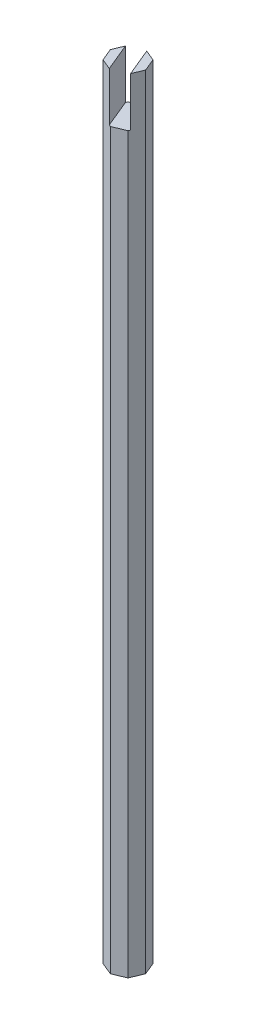
ISO-10303-21;
HEADER;
FILE_DESCRIPTION(('STEP AP214'),'2;1');
FILE_NAME('part.step','',(''),(''),'','','');
FILE_SCHEMA(('AUTOMOTIVE_DESIGN { 1 0 10303 214 1 1 1 1 }'));
ENDSEC;
DATA;
#1=APPLICATION_CONTEXT('core data for automotive mechanical design processes');
#2=APPLICATION_PROTOCOL_DEFINITION('international standard','automotive_design',2000,#1);
#3=PRODUCT_CONTEXT('',#1,'mechanical');
#4=PRODUCT('Part','Part','',(#3));
#5=PRODUCT_RELATED_PRODUCT_CATEGORY('part','',(#4));
#6=PRODUCT_DEFINITION_FORMATION('','',#4);
#7=PRODUCT_DEFINITION_CONTEXT('part definition',#1,'design');
#8=PRODUCT_DEFINITION('design','',#6,#7);
#9=PRODUCT_DEFINITION_SHAPE('','',#8);
#10=(LENGTH_UNIT() NAMED_UNIT(*) SI_UNIT(.MILLI.,.METRE.));
#11=(NAMED_UNIT(*) PLANE_ANGLE_UNIT() SI_UNIT($,.RADIAN.));
#12=(NAMED_UNIT(*) SI_UNIT($,.STERADIAN.) SOLID_ANGLE_UNIT());
#13=UNCERTAINTY_MEASURE_WITH_UNIT(LENGTH_MEASURE(1.E-05),#10,'distance_accuracy_value','');
#14=(GEOMETRIC_REPRESENTATION_CONTEXT(3) GLOBAL_UNCERTAINTY_ASSIGNED_CONTEXT((#13)) GLOBAL_UNIT_ASSIGNED_CONTEXT((#10,
#11,#12)) REPRESENTATION_CONTEXT('',''));
#15=CARTESIAN_POINT('',(0.,0.,0.));
#16=DIRECTION('',(0.,0.,1.));
#17=DIRECTION('',(1.,0.,0.));
#18=AXIS2_PLACEMENT_3D('',#15,#16,#17);
#19=CARTESIAN_POINT('',(-1.58536300828482E-13,609.6,-13.7463809437134));
#20=DIRECTION('',(0.3826834323651,0.,0.923879532511282));
#21=DIRECTION('',(0.923879532511282,0.,-0.3826834323651));
#22=AXIS2_PLACEMENT_3D('',#19,#20,#21);
#23=PLANE('',#22);
#24=DIRECTION('',(-0.92387953251128,0.,0.382683432365107));
#25=VECTOR('',#24,1.);
#26=CARTESIAN_POINT('',(-10.7267146224835,571.5,-9.30323026737482));
#27=LINE('',#26,#25);
#28=CARTESIAN_POINT('',(-1.75207071073658E-13,571.5,-13.7463809437134));
#29=VERTEX_POINT('',#28);
#30=CARTESIAN_POINT('',(-9.72015918207341,571.5,-9.72015918207312));
#31=VERTEX_POINT('',#30);
#32=EDGE_CURVE('E210',#29,#31,#27,.T.);
#33=ORIENTED_EDGE('',*,*,#32,.F.);
#34=DIRECTION('',(0.,-1.,0.));
#35=VECTOR('',#34,1.);
#36=CARTESIAN_POINT('',(-1.58536300828482E-13,609.6,-13.7463809437134));
#37=LINE('',#36,#35);
#38=CARTESIAN_POINT('',(-1.58536300828482E-13,0.,-13.7463809437134));
#39=VERTEX_POINT('',#38);
#40=EDGE_CURVE('E191',#29,#39,#37,.T.);
#41=ORIENTED_EDGE('',*,*,#40,.T.);
#42=DIRECTION('',(-0.923879532511282,0.,0.3826834323651));
#43=VECTOR('',#42,1.);
#44=CARTESIAN_POINT('',(-1.58536300828482E-13,0.,-13.7463809437134));
#45=LINE('',#44,#43);
#46=CARTESIAN_POINT('',(-9.72015918207339,0.,-9.72015918207317));
#47=VERTEX_POINT('',#46);
#48=EDGE_CURVE('E168',#39,#47,#45,.T.);
#49=ORIENTED_EDGE('',*,*,#48,.T.);
#50=DIRECTION('',(0.,-1.,0.));
#51=VECTOR('',#50,1.);
#52=CARTESIAN_POINT('',(-9.72015918207339,609.6,-9.72015918207317));
#53=LINE('',#52,#51);
#54=EDGE_CURVE('E189',#31,#47,#53,.T.);
#55=ORIENTED_EDGE('',*,*,#54,.F.);
#56=EDGE_LOOP('',(#33,#41,#49,#55));
#57=FACE_BOUND('',#56,.T.);
#58=ADVANCED_FACE('F35',(#57),#23,.F.);
#59=CARTESIAN_POINT('',(1.4871632129143E-13,609.6,13.7463809437134));
#60=DIRECTION('',(-0.382683432365099,0.,-0.923879532511283));
#61=DIRECTION('',(-0.923879532511283,0.,0.382683432365099));
#62=AXIS2_PLACEMENT_3D('',#59,#60,#61);
#63=PLANE('',#62);
#64=DIRECTION('',(0.923879532511279,0.,-0.382683432365107));
#65=VECTOR('',#64,1.);
#66=CARTESIAN_POINT('',(-1.00655544040976,571.5,14.1633098584117));
#67=LINE('',#66,#65);
#68=CARTESIAN_POINT('',(1.73038666728687E-13,571.5,13.7463809437135));
#69=VERTEX_POINT('',#68);
#70=CARTESIAN_POINT('',(9.72015918207338,571.5,9.72015918207314));
#71=VERTEX_POINT('',#70);
#72=EDGE_CURVE('E217',#69,#71,#67,.T.);
#73=ORIENTED_EDGE('',*,*,#72,.F.);
#74=DIRECTION('',(0.,-1.,0.));
#75=VECTOR('',#74,1.);
#76=CARTESIAN_POINT('',(1.4871632129143E-13,609.6,13.7463809437134));
#77=LINE('',#76,#75);
#78=CARTESIAN_POINT('',(1.4871632129143E-13,0.,13.7463809437134));
#79=VERTEX_POINT('',#78);
#80=EDGE_CURVE('E181',#69,#79,#77,.T.);
#81=ORIENTED_EDGE('',*,*,#80,.T.);
#82=DIRECTION('',(0.923879532511283,0.,-0.382683432365099));
#83=VECTOR('',#82,1.);
#84=CARTESIAN_POINT('',(1.4871632129143E-13,0.,13.7463809437134));
#85=LINE('',#84,#83);
#86=CARTESIAN_POINT('',(9.72015918207339,0.,9.72015918207317));
#87=VERTEX_POINT('',#86);
#88=EDGE_CURVE('E178',#79,#87,#85,.T.);
#89=ORIENTED_EDGE('',*,*,#88,.T.);
#90=DIRECTION('',(0.,-1.,0.));
#91=VECTOR('',#90,1.);
#92=CARTESIAN_POINT('',(9.72015918207339,609.6,9.72015918207317));
#93=LINE('',#92,#91);
#94=EDGE_CURVE('E93',#71,#87,#93,.T.);
#95=ORIENTED_EDGE('',*,*,#94,.F.);
#96=EDGE_LOOP('',(#73,#81,#89,#95));
#97=FACE_BOUND('',#96,.T.);
#98=ADVANCED_FACE('F236',(#97),#63,.F.);
#99=CARTESIAN_POINT('',(0.,609.6,0.));
#100=DIRECTION('',(0.,1.,0.));
#101=DIRECTION('',(0.,0.,1.));
#102=AXIS2_PLACEMENT_3D('',#99,#100,#101);
#103=PLANE('',#102);
#104=DIRECTION('',(0.382683432365107,0.,0.92387953251128));
#105=VECTOR('',#104,1.);
#106=CARTESIAN_POINT('',(-5.86663503144663,609.6,2.43003979551843));
#107=LINE('',#106,#105);
#108=CARTESIAN_POINT('',(-10.3097857077852,609.6,-8.29667482696475));
#109=VERTEX_POINT('',#108);
#110=CARTESIAN_POINT('',(-1.42348435510803,609.6,13.1567544180017));
#111=VERTEX_POINT('',#110);
#112=EDGE_CURVE('E11',#109,#111,#107,.T.);
#113=ORIENTED_EDGE('',*,*,#112,.F.);
#114=DIRECTION('',(-0.382683432365079,0.,0.923879532511291));
#115=VECTOR('',#114,1.);
#116=CARTESIAN_POINT('',(-9.72015918207339,609.6,-9.72015918207317));
#117=LINE('',#116,#115);
#118=CARTESIAN_POINT('',(-13.7463809437134,609.6,1.54522723592318E-13));
#119=VERTEX_POINT('',#118);
#120=EDGE_CURVE('E151',#109,#119,#117,.T.);
#121=ORIENTED_EDGE('',*,*,#120,.T.);
#122=DIRECTION('',(0.3826834323651,0.,0.923879532511282));
#123=VECTOR('',#122,1.);
#124=CARTESIAN_POINT('',(-13.7463809437134,609.6,1.54522723592318E-13));
#125=LINE('',#124,#123);
#126=CARTESIAN_POINT('',(-9.72015918207317,609.6,9.72015918207339));
#127=VERTEX_POINT('',#126);
#128=EDGE_CURVE('E59',#119,#127,#125,.T.);
#129=ORIENTED_EDGE('',*,*,#128,.T.);
#130=DIRECTION('',(0.923879532511291,0.,0.382683432365079));
#131=VECTOR('',#130,1.);
#132=CARTESIAN_POINT('',(-9.72015918207317,609.6,9.72015918207339));
#133=LINE('',#132,#131);
#134=EDGE_CURVE('E158',#127,#111,#133,.T.);
#135=ORIENTED_EDGE('',*,*,#134,.T.);
#136=EDGE_LOOP('',(#113,#121,#129,#135));
#137=FACE_BOUND('',#136,.T.);
#138=ADVANCED_FACE('F253',(#137),#103,.T.);
#139=CARTESIAN_POINT('',(9.72015918207339,609.6,9.72015918207317));
#140=DIRECTION('',(-0.923879532511291,0.,-0.382683432365079));
#141=DIRECTION('',(-0.382683432365079,0.,0.923879532511291));
#142=AXIS2_PLACEMENT_3D('',#139,#140,#141);
#143=PLANE('',#142);
#144=DIRECTION('',(0.382683432365079,0.,-0.923879532511291));
#145=VECTOR('',#144,1.);
#146=CARTESIAN_POINT('',(9.72015918207339,609.6,9.72015918207317));
#147=LINE('',#146,#145);
#148=CARTESIAN_POINT('',(10.3097857077852,609.6,8.29667482696476));
#149=VERTEX_POINT('',#148);
#150=CARTESIAN_POINT('',(13.7463809437134,609.6,-1.54522723592318E-13));
#151=VERTEX_POINT('',#150);
#152=EDGE_CURVE('E100',#149,#151,#147,.T.);
#153=ORIENTED_EDGE('',*,*,#152,.F.);
#154=DIRECTION('',(0.,-1.,0.));
#155=VECTOR('',#154,1.);
#156=CARTESIAN_POINT('',(10.3097857077852,609.6,8.29667482696476));
#157=LINE('',#156,#155);
#158=CARTESIAN_POINT('',(10.3097857077852,571.5,8.29667482696476));
#159=VERTEX_POINT('',#158);
#160=EDGE_CURVE('E50',#149,#159,#157,.T.);
#161=ORIENTED_EDGE('',*,*,#160,.T.);
#162=DIRECTION('',(0.382683432365079,0.,-0.923879532511291));
#163=VECTOR('',#162,1.);
#164=CARTESIAN_POINT('',(9.72015918207339,571.5,9.72015918207317));
#165=LINE('',#164,#163);
#166=EDGE_CURVE('E163',#71,#159,#165,.T.);
#167=ORIENTED_EDGE('',*,*,#166,.F.);
#168=ORIENTED_EDGE('',*,*,#94,.T.);
#169=DIRECTION('',(0.382683432365079,0.,-0.923879532511291));
#170=VECTOR('',#169,1.);
#171=CARTESIAN_POINT('',(9.72015918207339,0.,9.72015918207317));
#172=LINE('',#171,#170);
#173=CARTESIAN_POINT('',(13.7463809437134,0.,-1.54522723592318E-13));
#174=VERTEX_POINT('',#173);
#175=EDGE_CURVE('E160',#87,#174,#172,.T.);
#176=ORIENTED_EDGE('',*,*,#175,.T.);
#177=DIRECTION('',(0.,-1.,0.));
#178=VECTOR('',#177,1.);
#179=CARTESIAN_POINT('',(13.7463809437134,609.6,-1.54522723592318E-13));
#180=LINE('',#179,#178);
#181=EDGE_CURVE('E137',#151,#174,#180,.T.);
#182=ORIENTED_EDGE('',*,*,#181,.F.);
#183=EDGE_LOOP('',(#153,#161,#167,#168,#176,#182));
#184=FACE_BOUND('',#183,.T.);
#185=ADVANCED_FACE('F37',(#184),#143,.F.);
#186=CARTESIAN_POINT('',(13.7463809437134,609.6,-1.54522723592318E-13));
#187=DIRECTION('',(-0.923879532511282,0.,0.3826834323651));
#188=DIRECTION('',(0.3826834323651,0.,0.923879532511282));
#189=AXIS2_PLACEMENT_3D('',#186,#187,#188);
#190=PLANE('',#189);
#191=DIRECTION('',(-0.3826834323651,0.,-0.923879532511283));
#192=VECTOR('',#191,1.);
#193=CARTESIAN_POINT('',(13.7463809437134,0.,-1.54522723592318E-13));
#194=LINE('',#193,#192);
#195=CARTESIAN_POINT('',(9.72015918207317,0.,-9.7201591820734));
#196=VERTEX_POINT('',#195);
#197=EDGE_CURVE('E162',#174,#196,#194,.T.);
#198=ORIENTED_EDGE('',*,*,#197,.T.);
#199=DIRECTION('',(0.,-1.,0.));
#200=VECTOR('',#199,1.);
#201=CARTESIAN_POINT('',(9.72015918207317,609.6,-9.7201591820734));
#202=LINE('',#201,#200);
#203=CARTESIAN_POINT('',(9.72015918207317,609.6,-9.7201591820734));
#204=VERTEX_POINT('',#203);
#205=EDGE_CURVE('E193',#204,#196,#202,.T.);
#206=ORIENTED_EDGE('',*,*,#205,.F.);
#207=DIRECTION('',(-0.3826834323651,0.,-0.923879532511283));
#208=VECTOR('',#207,1.);
#209=CARTESIAN_POINT('',(13.7463809437134,609.6,-1.54522723592318E-13));
#210=LINE('',#209,#208);
#211=EDGE_CURVE('E149',#151,#204,#210,.T.);
#212=ORIENTED_EDGE('',*,*,#211,.F.);
#213=ORIENTED_EDGE('',*,*,#181,.T.);
#214=EDGE_LOOP('',(#198,#206,#212,#213));
#215=FACE_BOUND('',#214,.T.);
#216=ADVANCED_FACE('F198',(#215),#190,.F.);
#217=CARTESIAN_POINT('',(9.72015918207317,609.6,-9.7201591820734));
#218=DIRECTION('',(-0.382683432365079,0.,0.923879532511291));
#219=DIRECTION('',(0.923879532511291,0.,0.382683432365079));
#220=AXIS2_PLACEMENT_3D('',#217,#218,#219);
#221=PLANE('',#220);
#222=DIRECTION('',(-0.923879532511291,0.,-0.382683432365079));
#223=VECTOR('',#222,1.);
#224=CARTESIAN_POINT('',(9.72015918207317,571.5,-9.7201591820734));
#225=LINE('',#224,#223);
#226=CARTESIAN_POINT('',(1.42348435510802,571.5,-13.1567544180017));
#227=VERTEX_POINT('',#226);
#228=EDGE_CURVE('E145',#227,#29,#225,.T.);
#229=ORIENTED_EDGE('',*,*,#228,.F.);
#230=DIRECTION('',(0.,1.,0.));
#231=VECTOR('',#230,1.);
#232=CARTESIAN_POINT('',(1.42348435510803,609.6,-13.1567544180017));
#233=LINE('',#232,#231);
#234=CARTESIAN_POINT('',(1.42348435510803,609.6,-13.1567544180017));
#235=VERTEX_POINT('',#234);
#236=EDGE_CURVE('E134',#227,#235,#233,.T.);
#237=ORIENTED_EDGE('',*,*,#236,.T.);
#238=DIRECTION('',(-0.923879532511291,0.,-0.382683432365079));
#239=VECTOR('',#238,1.);
#240=CARTESIAN_POINT('',(9.72015918207317,609.6,-9.7201591820734));
#241=LINE('',#240,#239);
#242=EDGE_CURVE('E143',#204,#235,#241,.T.);
#243=ORIENTED_EDGE('',*,*,#242,.F.);
#244=ORIENTED_EDGE('',*,*,#205,.T.);
#245=DIRECTION('',(-0.923879532511291,0.,-0.382683432365079));
#246=VECTOR('',#245,1.);
#247=CARTESIAN_POINT('',(9.72015918207317,0.,-9.7201591820734));
#248=LINE('',#247,#246);
#249=EDGE_CURVE('E165',#196,#39,#248,.T.);
#250=ORIENTED_EDGE('',*,*,#249,.T.);
#251=ORIENTED_EDGE('',*,*,#40,.F.);
#252=EDGE_LOOP('',(#229,#237,#243,#244,#250,#251));
#253=FACE_BOUND('',#252,.T.);
#254=ADVANCED_FACE('F141',(#253),#221,.F.);
#255=CARTESIAN_POINT('',(-9.72015918207339,609.6,-9.72015918207317));
#256=DIRECTION('',(0.923879532511291,0.,0.382683432365079));
#257=DIRECTION('',(0.382683432365079,0.,-0.923879532511291));
#258=AXIS2_PLACEMENT_3D('',#255,#256,#257);
#259=PLANE('',#258);
#260=ORIENTED_EDGE('',*,*,#120,.F.);
#261=DIRECTION('',(0.,-1.,0.));
#262=VECTOR('',#261,1.);
#263=CARTESIAN_POINT('',(-10.3097857077852,609.6,-8.29667482696476));
#264=LINE('',#263,#262);
#265=CARTESIAN_POINT('',(-10.3097857077852,571.5,-8.29667482696474));
#266=VERTEX_POINT('',#265);
#267=EDGE_CURVE('E225',#109,#266,#264,.T.);
#268=ORIENTED_EDGE('',*,*,#267,.T.);
#269=DIRECTION('',(-0.382683432365079,0.,0.923879532511291));
#270=VECTOR('',#269,1.);
#271=CARTESIAN_POINT('',(-9.72015918207339,571.5,-9.72015918207317));
#272=LINE('',#271,#270);
#273=EDGE_CURVE('E230',#31,#266,#272,.T.);
#274=ORIENTED_EDGE('',*,*,#273,.F.);
#275=ORIENTED_EDGE('',*,*,#54,.T.);
#276=DIRECTION('',(-0.382683432365079,0.,0.923879532511291));
#277=VECTOR('',#276,1.);
#278=CARTESIAN_POINT('',(-9.72015918207339,0.,-9.72015918207317));
#279=LINE('',#278,#277);
#280=CARTESIAN_POINT('',(-13.7463809437134,0.,1.54522723592318E-13));
#281=VERTEX_POINT('',#280);
#282=EDGE_CURVE('E171',#47,#281,#279,.T.);
#283=ORIENTED_EDGE('',*,*,#282,.T.);
#284=DIRECTION('',(0.,-1.,0.));
#285=VECTOR('',#284,1.);
#286=CARTESIAN_POINT('',(-13.7463809437134,609.6,1.54522723592318E-13));
#287=LINE('',#286,#285);
#288=EDGE_CURVE('E186',#119,#281,#287,.T.);
#289=ORIENTED_EDGE('',*,*,#288,.F.);
#290=EDGE_LOOP('',(#260,#268,#274,#275,#283,#289));
#291=FACE_BOUND('',#290,.T.);
#292=ADVANCED_FACE('F248',(#291),#259,.F.);
#293=CARTESIAN_POINT('',(-13.7463809437134,609.6,1.54522723592318E-13));
#294=DIRECTION('',(0.923879532511282,0.,-0.3826834323651));
#295=DIRECTION('',(-0.3826834323651,0.,-0.923879532511282));
#296=AXIS2_PLACEMENT_3D('',#293,#294,#295);
#297=PLANE('',#296);
#298=DIRECTION('',(0.3826834323651,0.,0.923879532511282));
#299=VECTOR('',#298,1.);
#300=CARTESIAN_POINT('',(-13.7463809437134,0.,1.54522723592318E-13));
#301=LINE('',#300,#299);
#302=CARTESIAN_POINT('',(-9.72015918207317,0.,9.72015918207339));
#303=VERTEX_POINT('',#302);
#304=EDGE_CURVE('E173',#281,#303,#301,.T.);
#305=ORIENTED_EDGE('',*,*,#304,.T.);
#306=DIRECTION('',(0.,-1.,0.));
#307=VECTOR('',#306,1.);
#308=CARTESIAN_POINT('',(-9.72015918207317,609.6,9.72015918207339));
#309=LINE('',#308,#307);
#310=EDGE_CURVE('E183',#127,#303,#309,.T.);
#311=ORIENTED_EDGE('',*,*,#310,.F.);
#312=ORIENTED_EDGE('',*,*,#128,.F.);
#313=ORIENTED_EDGE('',*,*,#288,.T.);
#314=EDGE_LOOP('',(#305,#311,#312,#313));
#315=FACE_BOUND('',#314,.T.);
#316=ADVANCED_FACE('F244',(#315),#297,.F.);
#317=CARTESIAN_POINT('',(-9.72015918207317,609.6,9.72015918207339));
#318=DIRECTION('',(0.382683432365079,0.,-0.923879532511292));
#319=DIRECTION('',(-0.923879532511292,0.,-0.382683432365079));
#320=AXIS2_PLACEMENT_3D('',#317,#318,#319);
#321=PLANE('',#320);
#322=DIRECTION('',(0.923879532511292,0.,0.382683432365079));
#323=VECTOR('',#322,1.);
#324=CARTESIAN_POINT('',(-9.72015918207317,571.5,9.72015918207339));
#325=LINE('',#324,#323);
#326=CARTESIAN_POINT('',(-1.42348435510803,571.5,13.1567544180017));
#327=VERTEX_POINT('',#326);
#328=EDGE_CURVE('E228',#327,#69,#325,.T.);
#329=ORIENTED_EDGE('',*,*,#328,.F.);
#330=DIRECTION('',(0.,1.,0.));
#331=VECTOR('',#330,1.);
#332=CARTESIAN_POINT('',(-1.42348435510803,609.6,13.1567544180017));
#333=LINE('',#332,#331);
#334=EDGE_CURVE('E222',#327,#111,#333,.T.);
#335=ORIENTED_EDGE('',*,*,#334,.T.);
#336=ORIENTED_EDGE('',*,*,#134,.F.);
#337=ORIENTED_EDGE('',*,*,#310,.T.);
#338=DIRECTION('',(0.923879532511291,0.,0.382683432365079));
#339=VECTOR('',#338,1.);
#340=CARTESIAN_POINT('',(-9.72015918207317,0.,9.72015918207339));
#341=LINE('',#340,#339);
#342=EDGE_CURVE('E175',#303,#79,#341,.T.);
#343=ORIENTED_EDGE('',*,*,#342,.T.);
#344=ORIENTED_EDGE('',*,*,#80,.F.);
#345=EDGE_LOOP('',(#329,#335,#336,#337,#343,#344));
#346=FACE_BOUND('',#345,.T.);
#347=ADVANCED_FACE('F240',(#346),#321,.F.);
#348=DIRECTION('',(-0.382683432365107,0.,-0.92387953251128));
#349=VECTOR('',#348,1.);
#350=CARTESIAN_POINT('',(5.86663503144663,609.6,-2.43003979551843));
#351=LINE('',#350,#349);
#352=EDGE_CURVE('E43',#149,#235,#351,.T.);
#353=ORIENTED_EDGE('',*,*,#352,.F.);
#354=ORIENTED_EDGE('',*,*,#152,.T.);
#355=ORIENTED_EDGE('',*,*,#211,.T.);
#356=ORIENTED_EDGE('',*,*,#242,.T.);
#357=EDGE_LOOP('',(#353,#354,#355,#356));
#358=FACE_BOUND('',#357,.T.);
#359=ADVANCED_FACE('F148',(#358),#103,.T.);
#360=CARTESIAN_POINT('',(0.,0.,0.));
#361=DIRECTION('',(0.,1.,0.));
#362=DIRECTION('',(0.,0.,1.));
#363=AXIS2_PLACEMENT_3D('',#360,#361,#362);
#364=PLANE('',#363);
#365=ORIENTED_EDGE('',*,*,#175,.F.);
#366=ORIENTED_EDGE('',*,*,#88,.F.);
#367=ORIENTED_EDGE('',*,*,#342,.F.);
#368=ORIENTED_EDGE('',*,*,#304,.F.);
#369=ORIENTED_EDGE('',*,*,#282,.F.);
#370=ORIENTED_EDGE('',*,*,#48,.F.);
#371=ORIENTED_EDGE('',*,*,#249,.F.);
#372=ORIENTED_EDGE('',*,*,#197,.F.);
#373=EDGE_LOOP('',(#365,#366,#367,#368,#369,#370,#371,#372));
#374=FACE_BOUND('',#373,.T.);
#375=ADVANCED_FACE('F202',(#374),#364,.F.);
#376=CARTESIAN_POINT('',(0.,571.5,0.));
#377=DIRECTION('',(0.,1.,0.));
#378=DIRECTION('',(0.,0.,1.));
#379=AXIS2_PLACEMENT_3D('',#376,#377,#378);
#380=PLANE('',#379);
#381=ORIENTED_EDGE('',*,*,#166,.T.);
#382=DIRECTION('',(-0.382683432365107,0.,-0.923879532511279));
#383=VECTOR('',#382,1.);
#384=CARTESIAN_POINT('',(10.7267146224835,571.5,9.30323026737483));
#385=LINE('',#384,#383);
#386=EDGE_CURVE('E213',#159,#227,#385,.T.);
#387=ORIENTED_EDGE('',*,*,#386,.T.);
#388=ORIENTED_EDGE('',*,*,#228,.T.);
#389=ORIENTED_EDGE('',*,*,#32,.T.);
#390=ORIENTED_EDGE('',*,*,#273,.T.);
#391=DIRECTION('',(0.382683432365107,0.,0.923879532511279));
#392=VECTOR('',#391,1.);
#393=CARTESIAN_POINT('',(-1.00655544040976,571.5,14.1633098584117));
#394=LINE('',#393,#392);
#395=EDGE_CURVE('E146',#266,#327,#394,.T.);
#396=ORIENTED_EDGE('',*,*,#395,.T.);
#397=ORIENTED_EDGE('',*,*,#328,.T.);
#398=ORIENTED_EDGE('',*,*,#72,.T.);
#399=EDGE_LOOP('',(#381,#387,#388,#389,#390,#396,#397,#398));
#400=FACE_BOUND('',#399,.T.);
#401=ADVANCED_FACE('F233',(#400),#380,.T.);
#402=CARTESIAN_POINT('',(-1.00655544040976,571.5,14.1633098584117));
#403=DIRECTION('',(-0.92387953251128,0.,0.382683432365107));
#404=DIRECTION('',(0.382683432365107,0.,0.92387953251128));
#405=AXIS2_PLACEMENT_3D('',#402,#403,#404);
#406=PLANE('',#405);
#407=ORIENTED_EDGE('',*,*,#112,.T.);
#408=ORIENTED_EDGE('',*,*,#334,.F.);
#409=ORIENTED_EDGE('',*,*,#395,.F.);
#410=ORIENTED_EDGE('',*,*,#267,.F.);
#411=EDGE_LOOP('',(#407,#408,#409,#410));
#412=FACE_BOUND('',#411,.T.);
#413=ADVANCED_FACE('F251',(#412),#406,.F.);
#414=CARTESIAN_POINT('',(10.7267146224835,571.5,9.30323026737483));
#415=DIRECTION('',(0.92387953251128,0.,-0.382683432365107));
#416=DIRECTION('',(-0.382683432365107,0.,-0.92387953251128));
#417=AXIS2_PLACEMENT_3D('',#414,#415,#416);
#418=PLANE('',#417);
#419=ORIENTED_EDGE('',*,*,#352,.T.);
#420=ORIENTED_EDGE('',*,*,#236,.F.);
#421=ORIENTED_EDGE('',*,*,#386,.F.);
#422=ORIENTED_EDGE('',*,*,#160,.F.);
#423=EDGE_LOOP('',(#419,#420,#421,#422));
#424=FACE_BOUND('',#423,.T.);
#425=ADVANCED_FACE('F133',(#424),#418,.F.);
#426=CLOSED_SHELL('',(#58,#98,#138,#185,#216,#254,#292,#316,#347,#359,#375,#401,#413,#425));
#427=MANIFOLD_SOLID_BREP('B2',#426);
#428=ADVANCED_BREP_SHAPE_REPRESENTATION('',(#18,#427),#14);
#429=SHAPE_DEFINITION_REPRESENTATION(#9,#428);
ENDSEC;
END-ISO-10303-21;
